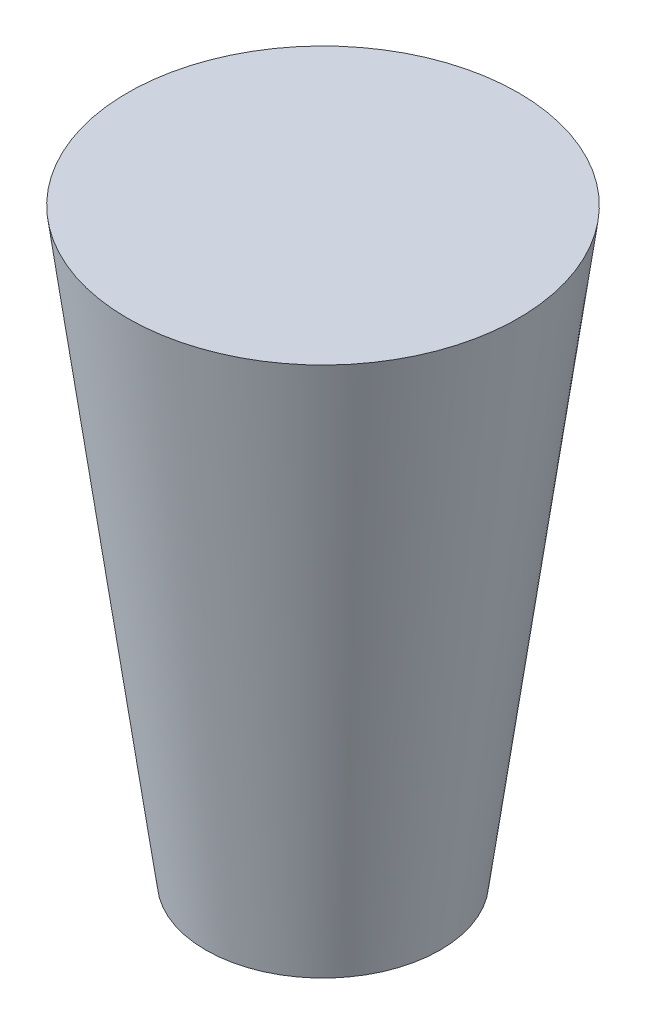
ISO-10303-21;
HEADER;
FILE_DESCRIPTION(('STEP AP214'),'2;1');
FILE_NAME('part.step','',(''),(''),'','','');
FILE_SCHEMA(('AUTOMOTIVE_DESIGN { 1 0 10303 214 1 1 1 1 }'));
ENDSEC;
DATA;
#1=APPLICATION_CONTEXT('core data for automotive mechanical design processes');
#2=APPLICATION_PROTOCOL_DEFINITION('international standard','automotive_design',2000,#1);
#3=PRODUCT_CONTEXT('',#1,'mechanical');
#4=PRODUCT('Part','Part','',(#3));
#5=PRODUCT_RELATED_PRODUCT_CATEGORY('part','',(#4));
#6=PRODUCT_DEFINITION_FORMATION('','',#4);
#7=PRODUCT_DEFINITION_CONTEXT('part definition',#1,'design');
#8=PRODUCT_DEFINITION('design','',#6,#7);
#9=PRODUCT_DEFINITION_SHAPE('','',#8);
#10=(LENGTH_UNIT() NAMED_UNIT(*) SI_UNIT(.MILLI.,.METRE.));
#11=(NAMED_UNIT(*) PLANE_ANGLE_UNIT() SI_UNIT($,.RADIAN.));
#12=(NAMED_UNIT(*) SI_UNIT($,.STERADIAN.) SOLID_ANGLE_UNIT());
#13=UNCERTAINTY_MEASURE_WITH_UNIT(LENGTH_MEASURE(1.E-05),#10,'distance_accuracy_value','');
#14=(GEOMETRIC_REPRESENTATION_CONTEXT(3) GLOBAL_UNCERTAINTY_ASSIGNED_CONTEXT((#13)) GLOBAL_UNIT_ASSIGNED_CONTEXT((#10,
#11,#12)) REPRESENTATION_CONTEXT('',''));
#15=CARTESIAN_POINT('',(0.,0.,0.));
#16=DIRECTION('',(0.,0.,1.));
#17=DIRECTION('',(1.,0.,0.));
#18=AXIS2_PLACEMENT_3D('',#15,#16,#17);
#19=CARTESIAN_POINT('',(0.,-50.,0.));
#20=DIRECTION('',(0.,-1.,0.));
#21=DIRECTION('',(0.,0.,-1.));
#22=AXIS2_PLACEMENT_3D('',#19,#20,#21);
#23=PLANE('',#22);
#24=CARTESIAN_POINT('',(0.,-50.,0.));
#25=DIRECTION('',(0.,1.,0.));
#26=DIRECTION('',(0.,0.,1.));
#27=AXIS2_PLACEMENT_3D('',#24,#25,#26);
#28=CIRCLE('',#27,30.);
#29=CARTESIAN_POINT('',(0.,-50.,30.));
#30=VERTEX_POINT('',#29);
#31=EDGE_CURVE('E10',#30,#30,#28,.T.);
#32=ORIENTED_EDGE('',*,*,#31,.F.);
#33=EDGE_LOOP('',(#32));
#34=FACE_BOUND('',#33,.T.);
#35=ADVANCED_FACE('F31',(#34),#23,.T.);
#36=CARTESIAN_POINT('',(0.,100.,0.));
#37=DIRECTION('',(0.,1.,0.));
#38=DIRECTION('',(0.,0.,1.));
#39=AXIS2_PLACEMENT_3D('',#36,#37,#38);
#40=CONICAL_SURFACE('',#39,50.,0.132551532296674);
#41=ORIENTED_EDGE('',*,*,#31,.T.);
#42=EDGE_LOOP('',(#41));
#43=FACE_BOUND('',#42,.T.);
#44=CARTESIAN_POINT('',(0.,100.,0.));
#45=DIRECTION('',(0.,1.,0.));
#46=DIRECTION('',(0.,0.,1.));
#47=AXIS2_PLACEMENT_3D('',#44,#45,#46);
#48=CIRCLE('',#47,50.);
#49=CARTESIAN_POINT('',(0.,100.,50.));
#50=VERTEX_POINT('',#49);
#51=EDGE_CURVE('E37',#50,#50,#48,.T.);
#52=ORIENTED_EDGE('',*,*,#51,.F.);
#53=EDGE_LOOP('',(#52));
#54=FACE_BOUND('',#53,.T.);
#55=ADVANCED_FACE('F45',(#43,#54),#40,.T.);
#56=CARTESIAN_POINT('',(-50.,100.,0.));
#57=DIRECTION('',(0.,1.,0.));
#58=DIRECTION('',(0.,0.,1.));
#59=AXIS2_PLACEMENT_3D('',#56,#57,#58);
#60=PLANE('',#59);
#61=ORIENTED_EDGE('',*,*,#51,.T.);
#62=EDGE_LOOP('',(#61));
#63=FACE_BOUND('',#62,.T.);
#64=ADVANCED_FACE('F43',(#63),#60,.T.);
#65=CLOSED_SHELL('',(#35,#55,#64));
#66=MANIFOLD_SOLID_BREP('B2',#65);
#67=ADVANCED_BREP_SHAPE_REPRESENTATION('',(#18,#66),#14);
#68=SHAPE_DEFINITION_REPRESENTATION(#9,#67);
ENDSEC;
END-ISO-10303-21;
